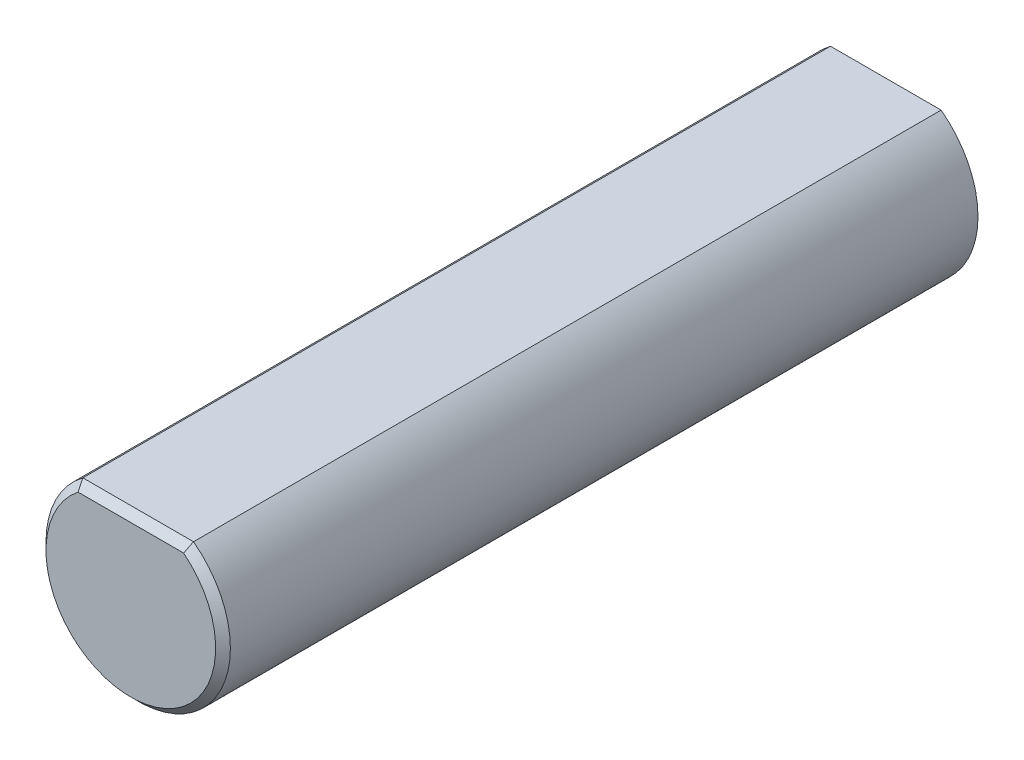
ISO-10303-21;
HEADER;
FILE_DESCRIPTION(('STEP AP214'),'2;1');
FILE_NAME('part.step','',(''),(''),'','','');
FILE_SCHEMA(('AUTOMOTIVE_DESIGN { 1 0 10303 214 1 1 1 1 }'));
ENDSEC;
DATA;
#1=APPLICATION_CONTEXT('core data for automotive mechanical design processes');
#2=APPLICATION_PROTOCOL_DEFINITION('international standard','automotive_design',2000,#1);
#3=PRODUCT_CONTEXT('',#1,'mechanical');
#4=PRODUCT('Part','Part','',(#3));
#5=PRODUCT_RELATED_PRODUCT_CATEGORY('part','',(#4));
#6=PRODUCT_DEFINITION_FORMATION('','',#4);
#7=PRODUCT_DEFINITION_CONTEXT('part definition',#1,'design');
#8=PRODUCT_DEFINITION('design','',#6,#7);
#9=PRODUCT_DEFINITION_SHAPE('','',#8);
#10=(LENGTH_UNIT() NAMED_UNIT(*) SI_UNIT(.MILLI.,.METRE.));
#11=(NAMED_UNIT(*) PLANE_ANGLE_UNIT() SI_UNIT($,.RADIAN.));
#12=(NAMED_UNIT(*) SI_UNIT($,.STERADIAN.) SOLID_ANGLE_UNIT());
#13=UNCERTAINTY_MEASURE_WITH_UNIT(LENGTH_MEASURE(1.E-05),#10,'distance_accuracy_value','');
#14=(GEOMETRIC_REPRESENTATION_CONTEXT(3) GLOBAL_UNCERTAINTY_ASSIGNED_CONTEXT((#13)) GLOBAL_UNIT_ASSIGNED_CONTEXT((#10,
#11,#12)) REPRESENTATION_CONTEXT('',''));
#15=CARTESIAN_POINT('',(0.,0.,0.));
#16=DIRECTION('',(0.,0.,1.));
#17=DIRECTION('',(1.,0.,0.));
#18=AXIS2_PLACEMENT_3D('',#15,#16,#17);
#19=CARTESIAN_POINT('',(0.,0.,26.));
#20=DIRECTION('',(0.,0.,-1.));
#21=DIRECTION('',(-1.,0.,0.));
#22=AXIS2_PLACEMENT_3D('',#19,#20,#21);
#23=CYLINDRICAL_SURFACE('',#22,3.175);
#24=DIRECTION('',(0.,0.,-1.));
#25=VECTOR('',#24,1.);
#26=CARTESIAN_POINT('',(1.905,2.54,26.));
#27=LINE('',#26,#25);
#28=CARTESIAN_POINT('',(1.905,2.54,25.746));
#29=VERTEX_POINT('',#28);
#30=CARTESIAN_POINT('',(1.905,2.54,0.));
#31=VERTEX_POINT('',#30);
#32=EDGE_CURVE('E81',#29,#31,#27,.T.);
#33=ORIENTED_EDGE('',*,*,#32,.F.);
#34=CARTESIAN_POINT('',(0.,0.,25.746));
#35=DIRECTION('',(0.,0.,1.));
#36=DIRECTION('',(1.,0.,0.));
#37=AXIS2_PLACEMENT_3D('',#34,#35,#36);
#38=CIRCLE('',#37,3.175);
#39=CARTESIAN_POINT('',(-1.905,2.54,25.746));
#40=VERTEX_POINT('',#39);
#41=EDGE_CURVE('E11',#29,#40,#38,.F.);
#42=ORIENTED_EDGE('',*,*,#41,.T.);
#43=DIRECTION('',(0.,0.,-1.));
#44=VECTOR('',#43,1.);
#45=CARTESIAN_POINT('',(-1.905,2.54,26.));
#46=LINE('',#45,#44);
#47=CARTESIAN_POINT('',(-1.905,2.54,0.));
#48=VERTEX_POINT('',#47);
#49=EDGE_CURVE('E89',#40,#48,#46,.T.);
#50=ORIENTED_EDGE('',*,*,#49,.T.);
#51=CARTESIAN_POINT('',(0.,0.,0.));
#52=DIRECTION('',(0.,0.,1.));
#53=DIRECTION('',(1.,0.,0.));
#54=AXIS2_PLACEMENT_3D('',#51,#52,#53);
#55=CIRCLE('',#54,3.175);
#56=EDGE_CURVE('E93',#48,#31,#55,.T.);
#57=ORIENTED_EDGE('',*,*,#56,.T.);
#58=EDGE_LOOP('',(#33,#42,#50,#57));
#59=FACE_BOUND('',#58,.T.);
#60=ADVANCED_FACE('F39',(#59),#23,.T.);
#61=CARTESIAN_POINT('',(1.905,2.54,26.));
#62=DIRECTION('',(0.,-1.,0.));
#63=DIRECTION('',(0.,0.,-1.));
#64=AXIS2_PLACEMENT_3D('',#61,#62,#63);
#65=PLANE('',#64);
#66=ORIENTED_EDGE('',*,*,#49,.F.);
#67=DIRECTION('',(1.,0.,0.));
#68=VECTOR('',#67,1.);
#69=CARTESIAN_POINT('',(1.905,2.54,25.746));
#70=LINE('',#69,#68);
#71=EDGE_CURVE('E54',#40,#29,#70,.T.);
#72=ORIENTED_EDGE('',*,*,#71,.T.);
#73=ORIENTED_EDGE('',*,*,#32,.T.);
#74=DIRECTION('',(-1.,0.,0.));
#75=VECTOR('',#74,1.);
#76=CARTESIAN_POINT('',(1.905,2.54,0.));
#77=LINE('',#76,#75);
#78=EDGE_CURVE('E84',#31,#48,#77,.T.);
#79=ORIENTED_EDGE('',*,*,#78,.T.);
#80=EDGE_LOOP('',(#66,#72,#73,#79));
#81=FACE_BOUND('',#80,.T.);
#82=ADVANCED_FACE('F83',(#81),#65,.F.);
#83=CARTESIAN_POINT('',(0.,0.,26.));
#84=DIRECTION('',(0.,0.,1.));
#85=DIRECTION('',(1.,0.,0.));
#86=AXIS2_PLACEMENT_3D('',#83,#84,#85);
#87=PLANE('',#86);
#88=CARTESIAN_POINT('',(0.,0.,26.));
#89=DIRECTION('',(0.,0.,1.));
#90=DIRECTION('',(1.,0.,0.));
#91=AXIS2_PLACEMENT_3D('',#88,#89,#90);
#92=CIRCLE('',#91,2.92100000000001);
#93=CARTESIAN_POINT('',(-1.81836327503614,2.28599999999997,26.));
#94=VERTEX_POINT('',#93);
#95=CARTESIAN_POINT('',(1.81836327503614,2.28599999999997,26.));
#96=VERTEX_POINT('',#95);
#97=EDGE_CURVE('E88',#94,#96,#92,.T.);
#98=ORIENTED_EDGE('',*,*,#97,.T.);
#99=DIRECTION('',(-1.,0.,0.));
#100=VECTOR('',#99,1.);
#101=CARTESIAN_POINT('',(-1.905,2.28600000000001,26.));
#102=LINE('',#101,#100);
#103=EDGE_CURVE('E105',#96,#94,#102,.T.);
#104=ORIENTED_EDGE('',*,*,#103,.T.);
#105=EDGE_LOOP('',(#98,#104));
#106=FACE_BOUND('',#105,.T.);
#107=ADVANCED_FACE('F125',(#106),#87,.T.);
#108=CARTESIAN_POINT('',(0.,0.,0.));
#109=DIRECTION('',(0.,0.,1.));
#110=DIRECTION('',(1.,0.,0.));
#111=AXIS2_PLACEMENT_3D('',#108,#109,#110);
#112=PLANE('',#111);
#113=ORIENTED_EDGE('',*,*,#56,.F.);
#114=ORIENTED_EDGE('',*,*,#78,.F.);
#115=EDGE_LOOP('',(#113,#114));
#116=FACE_BOUND('',#115,.T.);
#117=ADVANCED_FACE('F92',(#116),#112,.F.);
#118=CARTESIAN_POINT('',(0.,0.,26.));
#119=DIRECTION('',(0.,0.,-1.));
#120=DIRECTION('',(-1.,0.,0.));
#121=AXIS2_PLACEMENT_3D('',#118,#119,#120);
#122=CONICAL_SURFACE('',#121,2.92100000000001,0.785398163397447);
#123=CARTESIAN_POINT('',(-1.81836327503617,2.28600000000001,26.));
#124=CARTESIAN_POINT('',(-1.8331202081611,2.32827920209276,25.9577207979072));
#125=CARTESIAN_POINT('',(-1.84771840387271,2.37058547601538,25.9154145239846));
#126=CARTESIAN_POINT('',(-1.87659731200799,2.45525214271377,25.8307478572862));
#127=CARTESIAN_POINT('',(-1.8908780246177,2.4976125354578,25.7883874645422));
#128=CARTESIAN_POINT('',(-1.90500000000012,2.53999999999998,25.746));
#129=B_SPLINE_CURVE_WITH_KNOTS('',3,(#123,#124,#125,#126,#127,#128),.UNSPECIFIED.,.F.,.F.,(4,2,
4),(0.,0.18475589435847,0.36951168045322),.UNSPECIFIED.);
#130=EDGE_CURVE('E99',#40,#94,#129,.F.);
#131=ORIENTED_EDGE('',*,*,#130,.F.);
#132=ORIENTED_EDGE('',*,*,#41,.F.);
#133=CARTESIAN_POINT('',(1.905,2.54,25.746));
#134=CARTESIAN_POINT('',(1.89087802461764,2.49761253545781,25.7883874645422));
#135=CARTESIAN_POINT('',(1.87659731200796,2.45525214271377,25.8307478572862));
#136=CARTESIAN_POINT('',(1.84771840387273,2.37058547601538,25.9154145239846));
#137=CARTESIAN_POINT('',(1.83312020816114,2.32827920209275,25.9577207979072));
#138=CARTESIAN_POINT('',(1.81836327503621,2.286,26.));
#139=B_SPLINE_CURVE_WITH_KNOTS('',3,(#133,#134,#135,#136,#137,#138),.UNSPECIFIED.,.F.,.F.,(4,2,
4),(0.,0.18475578609475,0.369511680453221),.UNSPECIFIED.);
#140=EDGE_CURVE('E44',#96,#29,#139,.F.);
#141=ORIENTED_EDGE('',*,*,#140,.F.);
#142=ORIENTED_EDGE('',*,*,#97,.F.);
#143=EDGE_LOOP('',(#131,#132,#141,#142));
#144=FACE_BOUND('',#143,.T.);
#145=ADVANCED_FACE('F115',(#144),#122,.T.);
#146=CARTESIAN_POINT('',(0.,2.28600000000001,26.));
#147=DIRECTION('',(0.,0.707106781186548,0.707106781186547));
#148=DIRECTION('',(1.,0.,0.));
#149=AXIS2_PLACEMENT_3D('',#146,#147,#148);
#150=PLANE('',#149);
#151=ORIENTED_EDGE('',*,*,#140,.T.);
#152=ORIENTED_EDGE('',*,*,#71,.F.);
#153=ORIENTED_EDGE('',*,*,#130,.T.);
#154=ORIENTED_EDGE('',*,*,#103,.F.);
#155=EDGE_LOOP('',(#151,#152,#153,#154));
#156=FACE_BOUND('',#155,.T.);
#157=ADVANCED_FACE('F41',(#156),#150,.T.);
#158=CLOSED_SHELL('',(#60,#82,#107,#117,#145,#157));
#159=MANIFOLD_SOLID_BREP('B2',#158);
#160=ADVANCED_BREP_SHAPE_REPRESENTATION('',(#18,#159),#14);
#161=SHAPE_DEFINITION_REPRESENTATION(#9,#160);
ENDSEC;
END-ISO-10303-21;
